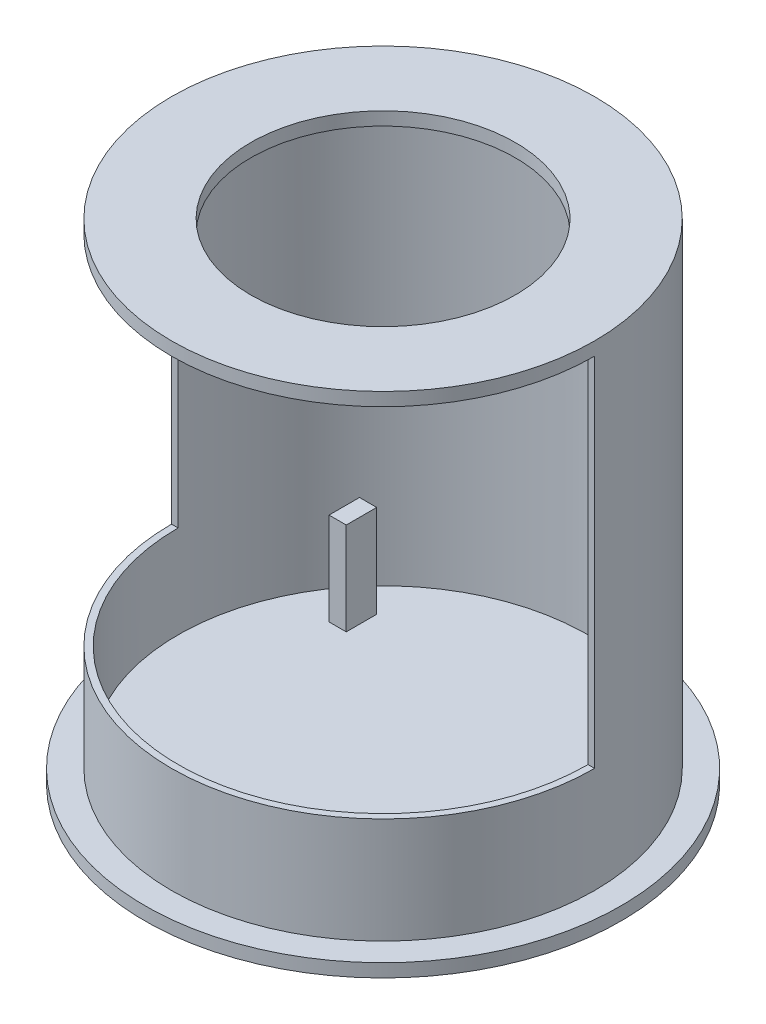
ISO-10303-21;
HEADER;
FILE_DESCRIPTION(('STEP AP214'),'2;1');
FILE_NAME('part.step','',(''),(''),'','','');
FILE_SCHEMA(('AUTOMOTIVE_DESIGN { 1 0 10303 214 1 1 1 1 }'));
ENDSEC;
DATA;
#1=APPLICATION_CONTEXT('core data for automotive mechanical design processes');
#2=APPLICATION_PROTOCOL_DEFINITION('international standard','automotive_design',2000,#1);
#3=PRODUCT_CONTEXT('',#1,'mechanical');
#4=PRODUCT('Part','Part','',(#3));
#5=PRODUCT_RELATED_PRODUCT_CATEGORY('part','',(#4));
#6=PRODUCT_DEFINITION_FORMATION('','',#4);
#7=PRODUCT_DEFINITION_CONTEXT('part definition',#1,'design');
#8=PRODUCT_DEFINITION('design','',#6,#7);
#9=PRODUCT_DEFINITION_SHAPE('','',#8);
#10=(LENGTH_UNIT() NAMED_UNIT(*) SI_UNIT(.MILLI.,.METRE.));
#11=(NAMED_UNIT(*) PLANE_ANGLE_UNIT() SI_UNIT($,.RADIAN.));
#12=(NAMED_UNIT(*) SI_UNIT($,.STERADIAN.) SOLID_ANGLE_UNIT());
#13=UNCERTAINTY_MEASURE_WITH_UNIT(LENGTH_MEASURE(1.E-05),#10,'distance_accuracy_value','');
#14=(GEOMETRIC_REPRESENTATION_CONTEXT(3) GLOBAL_UNCERTAINTY_ASSIGNED_CONTEXT((#13)) GLOBAL_UNIT_ASSIGNED_CONTEXT((#10,
#11,#12)) REPRESENTATION_CONTEXT('',''));
#15=CARTESIAN_POINT('',(0.,0.,0.));
#16=DIRECTION('',(0.,0.,1.));
#17=DIRECTION('',(1.,0.,0.));
#18=AXIS2_PLACEMENT_3D('',#15,#16,#17);
#19=CARTESIAN_POINT('',(0.,5.,0.));
#20=DIRECTION('',(0.,1.,0.));
#21=DIRECTION('',(0.,0.,1.));
#22=AXIS2_PLACEMENT_3D('',#19,#20,#21);
#23=PLANE('',#22);
#24=CARTESIAN_POINT('',(0.,5.,0.));
#25=DIRECTION('',(0.,1.,0.));
#26=DIRECTION('',(0.,0.,1.));
#27=AXIS2_PLACEMENT_3D('',#24,#25,#26);
#28=CIRCLE('',#27,77.5);
#29=CARTESIAN_POINT('',(0.,5.,77.5));
#30=VERTEX_POINT('',#29);
#31=EDGE_CURVE('E11',#30,#30,#28,.T.);
#32=ORIENTED_EDGE('',*,*,#31,.T.);
#33=EDGE_LOOP('',(#32));
#34=FACE_BOUND('',#33,.T.);
#35=DIRECTION('',(0.,0.,-1.));
#36=VECTOR('',#35,1.);
#37=CARTESIAN_POINT('',(-46.67,5.,0.));
#38=LINE('',#37,#36);
#39=CARTESIAN_POINT('',(-46.67,5.,-32.75));
#40=VERTEX_POINT('',#39);
#41=CARTESIAN_POINT('',(-46.67,5.,-44.2582298009128));
#42=VERTEX_POINT('',#41);
#43=EDGE_CURVE('E171',#40,#42,#38,.T.);
#44=ORIENTED_EDGE('',*,*,#43,.F.);
#45=DIRECTION('',(1.,0.,0.));
#46=VECTOR('',#45,1.);
#47=CARTESIAN_POINT('',(0.,5.,-32.7499999999999));
#48=LINE('',#47,#46);
#49=CARTESIAN_POINT('',(-53.17,5.,-32.75));
#50=VERTEX_POINT('',#49);
#51=EDGE_CURVE('E130',#50,#40,#48,.T.);
#52=ORIENTED_EDGE('',*,*,#51,.F.);
#53=DIRECTION('',(0.,0.,-1.));
#54=VECTOR('',#53,1.);
#55=CARTESIAN_POINT('',(-53.17,5.,0.));
#56=LINE('',#55,#54);
#57=CARTESIAN_POINT('',(-53.17,5.,-44.2582298009127));
#58=VERTEX_POINT('',#57);
#59=EDGE_CURVE('E160',#50,#58,#56,.T.);
#60=ORIENTED_EDGE('',*,*,#59,.T.);
#61=DIRECTION('',(1.,0.,0.));
#62=VECTOR('',#61,1.);
#63=CARTESIAN_POINT('',(0.,5.,-44.2582298009128));
#64=LINE('',#63,#62);
#65=EDGE_CURVE('E174',#58,#42,#64,.T.);
#66=ORIENTED_EDGE('',*,*,#65,.T.);
#67=EDGE_LOOP('',(#44,#52,#60,#66));
#68=FACE_BOUND('',#67,.T.);
#69=DIRECTION('',(0.,0.,1.));
#70=VECTOR('',#69,1.);
#71=CARTESIAN_POINT('',(46.67,5.,-44.26));
#72=LINE('',#71,#70);
#73=CARTESIAN_POINT('',(46.67,5.,-44.26));
#74=VERTEX_POINT('',#73);
#75=CARTESIAN_POINT('',(46.67,5.,-32.75));
#76=VERTEX_POINT('',#75);
#77=EDGE_CURVE('E52',#74,#76,#72,.T.);
#78=ORIENTED_EDGE('',*,*,#77,.F.);
#79=DIRECTION('',(-1.,0.,0.));
#80=VECTOR('',#79,1.);
#81=CARTESIAN_POINT('',(53.17,5.,-44.26));
#82=LINE('',#81,#80);
#83=CARTESIAN_POINT('',(53.17,5.,-44.26));
#84=VERTEX_POINT('',#83);
#85=EDGE_CURVE('E123',#84,#74,#82,.T.);
#86=ORIENTED_EDGE('',*,*,#85,.F.);
#87=DIRECTION('',(0.,0.,1.));
#88=VECTOR('',#87,1.);
#89=CARTESIAN_POINT('',(53.17,5.,-44.26));
#90=LINE('',#89,#88);
#91=CARTESIAN_POINT('',(53.17,5.,-32.75));
#92=VERTEX_POINT('',#91);
#93=EDGE_CURVE('E126',#84,#92,#90,.T.);
#94=ORIENTED_EDGE('',*,*,#93,.T.);
#95=DIRECTION('',(-1.,0.,0.));
#96=VECTOR('',#95,1.);
#97=CARTESIAN_POINT('',(53.17,5.,-32.75));
#98=LINE('',#97,#96);
#99=EDGE_CURVE('E57',#92,#76,#98,.T.);
#100=ORIENTED_EDGE('',*,*,#99,.T.);
#101=EDGE_LOOP('',(#78,#86,#94,#100));
#102=FACE_BOUND('',#101,.T.);
#103=ADVANCED_FACE('F37',(#34,#68,#102),#23,.T.);
#104=CARTESIAN_POINT('',(0.,5.,0.));
#105=DIRECTION('',(0.,0.,-1.));
#106=DIRECTION('',(-1.,0.,0.));
#107=AXIS2_PLACEMENT_3D('',#104,#105,#106);
#108=PLANE('',#107);
#109=DIRECTION('',(1.,0.,0.));
#110=VECTOR('',#109,1.);
#111=CARTESIAN_POINT('',(0.,175.,0.));
#112=LINE('',#111,#110);
#113=CARTESIAN_POINT('',(-80.,175.,0.));
#114=VERTEX_POINT('',#113);
#115=CARTESIAN_POINT('',(-77.5,175.,0.));
#116=VERTEX_POINT('',#115);
#117=EDGE_CURVE('E191',#114,#116,#112,.T.);
#118=ORIENTED_EDGE('',*,*,#117,.F.);
#119=DIRECTION('',(0.,-1.,0.));
#120=VECTOR('',#119,1.);
#121=CARTESIAN_POINT('',(-80.,180.,0.));
#122=LINE('',#121,#120);
#123=CARTESIAN_POINT('',(-80.,40.0000000000001,0.));
#124=VERTEX_POINT('',#123);
#125=EDGE_CURVE('E45',#114,#124,#122,.T.);
#126=ORIENTED_EDGE('',*,*,#125,.T.);
#127=DIRECTION('',(-1.,0.,0.));
#128=VECTOR('',#127,1.);
#129=CARTESIAN_POINT('',(0.,40.,0.));
#130=LINE('',#129,#128);
#131=CARTESIAN_POINT('',(-77.5,40.0000000000001,0.));
#132=VERTEX_POINT('',#131);
#133=EDGE_CURVE('E210',#132,#124,#130,.T.);
#134=ORIENTED_EDGE('',*,*,#133,.F.);
#135=DIRECTION('',(0.,-1.,0.));
#136=VECTOR('',#135,1.);
#137=CARTESIAN_POINT('',(-77.5,180.,0.));
#138=LINE('',#137,#136);
#139=EDGE_CURVE('E230',#116,#132,#138,.T.);
#140=ORIENTED_EDGE('',*,*,#139,.F.);
#141=EDGE_LOOP('',(#118,#126,#134,#140));
#142=FACE_BOUND('',#141,.T.);
#143=ADVANCED_FACE('F39',(#142),#108,.F.);
#144=DIRECTION('',(1.,0.,0.));
#145=VECTOR('',#144,1.);
#146=CARTESIAN_POINT('',(0.,175.,0.));
#147=LINE('',#146,#145);
#148=CARTESIAN_POINT('',(77.5,175.,0.));
#149=VERTEX_POINT('',#148);
#150=CARTESIAN_POINT('',(80.,175.,0.));
#151=VERTEX_POINT('',#150);
#152=EDGE_CURVE('E188',#149,#151,#147,.T.);
#153=ORIENTED_EDGE('',*,*,#152,.F.);
#154=DIRECTION('',(0.,-1.,0.));
#155=VECTOR('',#154,1.);
#156=CARTESIAN_POINT('',(77.5,180.,0.));
#157=LINE('',#156,#155);
#158=CARTESIAN_POINT('',(77.5,40.,0.));
#159=VERTEX_POINT('',#158);
#160=EDGE_CURVE('E233',#149,#159,#157,.T.);
#161=ORIENTED_EDGE('',*,*,#160,.T.);
#162=DIRECTION('',(1.,0.,0.));
#163=VECTOR('',#162,1.);
#164=CARTESIAN_POINT('',(0.,40.,0.));
#165=LINE('',#164,#163);
#166=CARTESIAN_POINT('',(80.,40.,0.));
#167=VERTEX_POINT('',#166);
#168=EDGE_CURVE('E204',#159,#167,#165,.T.);
#169=ORIENTED_EDGE('',*,*,#168,.T.);
#170=DIRECTION('',(0.,-1.,0.));
#171=VECTOR('',#170,1.);
#172=CARTESIAN_POINT('',(80.,180.,0.));
#173=LINE('',#172,#171);
#174=EDGE_CURVE('E228',#151,#167,#173,.T.);
#175=ORIENTED_EDGE('',*,*,#174,.F.);
#176=EDGE_LOOP('',(#153,#161,#169,#175));
#177=FACE_BOUND('',#176,.T.);
#178=ADVANCED_FACE('F245',(#177),#108,.F.);
#179=CARTESIAN_POINT('',(0.,180.,0.));
#180=DIRECTION('',(0.,-1.,0.));
#181=DIRECTION('',(0.,0.,-1.));
#182=AXIS2_PLACEMENT_3D('',#179,#180,#181);
#183=CYLINDRICAL_SURFACE('',#182,77.5);
#184=ORIENTED_EDGE('',*,*,#31,.F.);
#185=EDGE_LOOP('',(#184));
#186=FACE_BOUND('',#185,.T.);
#187=CARTESIAN_POINT('',(0.,175.,0.));
#188=DIRECTION('',(0.,1.,0.));
#189=DIRECTION('',(0.,0.,1.));
#190=AXIS2_PLACEMENT_3D('',#187,#188,#189);
#191=CIRCLE('',#190,77.5);
#192=EDGE_CURVE('E220',#149,#116,#191,.T.);
#193=ORIENTED_EDGE('',*,*,#192,.T.);
#194=ORIENTED_EDGE('',*,*,#139,.T.);
#195=CARTESIAN_POINT('',(0.,40.,0.));
#196=DIRECTION('',(0.,1.,0.));
#197=DIRECTION('',(0.,0.,1.));
#198=AXIS2_PLACEMENT_3D('',#195,#196,#197);
#199=CIRCLE('',#198,77.5);
#200=EDGE_CURVE('E207',#159,#132,#199,.F.);
#201=ORIENTED_EDGE('',*,*,#200,.F.);
#202=ORIENTED_EDGE('',*,*,#160,.F.);
#203=EDGE_LOOP('',(#193,#194,#201,#202));
#204=FACE_BOUND('',#203,.T.);
#205=ADVANCED_FACE('F249',(#186,#204),#183,.F.);
#206=CARTESIAN_POINT('',(0.,180.,0.));
#207=DIRECTION('',(0.,-1.,0.));
#208=DIRECTION('',(0.,0.,-1.));
#209=AXIS2_PLACEMENT_3D('',#206,#207,#208);
#210=CYLINDRICAL_SURFACE('',#209,80.);
#211=CARTESIAN_POINT('',(0.,175.,0.));
#212=DIRECTION('',(0.,1.,0.));
#213=DIRECTION('',(0.,0.,1.));
#214=AXIS2_PLACEMENT_3D('',#211,#212,#213);
#215=CIRCLE('',#214,80.);
#216=EDGE_CURVE('E193',#151,#114,#215,.F.);
#217=ORIENTED_EDGE('',*,*,#216,.F.);
#218=ORIENTED_EDGE('',*,*,#174,.T.);
#219=CARTESIAN_POINT('',(0.,40.,0.));
#220=DIRECTION('',(0.,1.,0.));
#221=DIRECTION('',(0.,0.,1.));
#222=AXIS2_PLACEMENT_3D('',#219,#220,#221);
#223=CIRCLE('',#222,80.);
#224=EDGE_CURVE('E213',#167,#124,#223,.F.);
#225=ORIENTED_EDGE('',*,*,#224,.T.);
#226=ORIENTED_EDGE('',*,*,#125,.F.);
#227=EDGE_LOOP('',(#217,#218,#225,#226));
#228=FACE_BOUND('',#227,.T.);
#229=CARTESIAN_POINT('',(0.,0.,0.));
#230=DIRECTION('',(0.,-1.,0.));
#231=DIRECTION('',(0.,0.,-1.));
#232=AXIS2_PLACEMENT_3D('',#229,#230,#231);
#233=CIRCLE('',#232,80.);
#234=CARTESIAN_POINT('',(0.,0.,-80.));
#235=VERTEX_POINT('',#234);
#236=EDGE_CURVE('E199',#235,#235,#233,.T.);
#237=ORIENTED_EDGE('',*,*,#236,.F.);
#238=EDGE_LOOP('',(#237));
#239=FACE_BOUND('',#238,.T.);
#240=CARTESIAN_POINT('',(0.,180.,0.));
#241=DIRECTION('',(0.,-1.,0.));
#242=DIRECTION('',(0.,0.,-1.));
#243=AXIS2_PLACEMENT_3D('',#240,#241,#242);
#244=CIRCLE('',#243,80.);
#245=CARTESIAN_POINT('',(0.,180.,-80.));
#246=VERTEX_POINT('',#245);
#247=EDGE_CURVE('E225',#246,#246,#244,.F.);
#248=ORIENTED_EDGE('',*,*,#247,.F.);
#249=EDGE_LOOP('',(#248));
#250=FACE_BOUND('',#249,.T.);
#251=ADVANCED_FACE('F238',(#228,#239,#250),#210,.T.);
#252=CARTESIAN_POINT('',(0.,180.,0.));
#253=DIRECTION('',(0.,-1.,0.));
#254=DIRECTION('',(0.,0.,-1.));
#255=AXIS2_PLACEMENT_3D('',#252,#253,#254);
#256=PLANE('',#255);
#257=ORIENTED_EDGE('',*,*,#247,.T.);
#258=EDGE_LOOP('',(#257));
#259=FACE_BOUND('',#258,.T.);
#260=CARTESIAN_POINT('',(0.,180.,0.));
#261=DIRECTION('',(0.,1.,0.));
#262=DIRECTION('',(0.,0.,1.));
#263=AXIS2_PLACEMENT_3D('',#260,#261,#262);
#264=CIRCLE('',#263,50.);
#265=CARTESIAN_POINT('',(0.,180.,50.));
#266=VERTEX_POINT('',#265);
#267=EDGE_CURVE('E216',#266,#266,#264,.T.);
#268=ORIENTED_EDGE('',*,*,#267,.F.);
#269=EDGE_LOOP('',(#268));
#270=FACE_BOUND('',#269,.T.);
#271=ADVANCED_FACE('F257',(#259,#270),#256,.F.);
#272=CARTESIAN_POINT('',(0.,175.,0.));
#273=DIRECTION('',(0.,1.,0.));
#274=DIRECTION('',(0.,0.,1.));
#275=AXIS2_PLACEMENT_3D('',#272,#273,#274);
#276=PLANE('',#275);
#277=CARTESIAN_POINT('',(0.,175.,0.));
#278=DIRECTION('',(0.,1.,0.));
#279=DIRECTION('',(0.,0.,1.));
#280=AXIS2_PLACEMENT_3D('',#277,#278,#279);
#281=CIRCLE('',#280,50.);
#282=CARTESIAN_POINT('',(0.,175.,50.));
#283=VERTEX_POINT('',#282);
#284=EDGE_CURVE('E217',#283,#283,#281,.T.);
#285=ORIENTED_EDGE('',*,*,#284,.T.);
#286=EDGE_LOOP('',(#285));
#287=FACE_BOUND('',#286,.T.);
#288=ORIENTED_EDGE('',*,*,#192,.F.);
#289=ORIENTED_EDGE('',*,*,#152,.T.);
#290=ORIENTED_EDGE('',*,*,#216,.T.);
#291=ORIENTED_EDGE('',*,*,#117,.T.);
#292=EDGE_LOOP('',(#288,#289,#290,#291));
#293=FACE_BOUND('',#292,.T.);
#294=ADVANCED_FACE('F254',(#287,#293),#276,.F.);
#295=CARTESIAN_POINT('',(0.,175.,0.));
#296=DIRECTION('',(0.,1.,0.));
#297=DIRECTION('',(0.,0.,1.));
#298=AXIS2_PLACEMENT_3D('',#295,#296,#297);
#299=CYLINDRICAL_SURFACE('',#298,50.);
#300=ORIENTED_EDGE('',*,*,#267,.T.);
#301=EDGE_LOOP('',(#300));
#302=FACE_BOUND('',#301,.T.);
#303=ORIENTED_EDGE('',*,*,#284,.F.);
#304=EDGE_LOOP('',(#303));
#305=FACE_BOUND('',#304,.T.);
#306=ADVANCED_FACE('F256',(#302,#305),#299,.F.);
#307=CARTESIAN_POINT('',(0.,40.,0.));
#308=DIRECTION('',(0.,1.,0.));
#309=DIRECTION('',(0.,0.,1.));
#310=AXIS2_PLACEMENT_3D('',#307,#308,#309);
#311=PLANE('',#310);
#312=ORIENTED_EDGE('',*,*,#168,.F.);
#313=ORIENTED_EDGE('',*,*,#200,.T.);
#314=ORIENTED_EDGE('',*,*,#133,.T.);
#315=ORIENTED_EDGE('',*,*,#224,.F.);
#316=EDGE_LOOP('',(#312,#313,#314,#315));
#317=FACE_BOUND('',#316,.T.);
#318=ADVANCED_FACE('F244',(#317),#311,.T.);
#319=CARTESIAN_POINT('',(0.,-5.,0.));
#320=DIRECTION('',(0.,1.,0.));
#321=DIRECTION('',(0.,0.,1.));
#322=AXIS2_PLACEMENT_3D('',#319,#320,#321);
#323=CYLINDRICAL_SURFACE('',#322,90.);
#324=CARTESIAN_POINT('',(0.,-5.,0.));
#325=DIRECTION('',(0.,-1.,0.));
#326=DIRECTION('',(0.,0.,-1.));
#327=AXIS2_PLACEMENT_3D('',#324,#325,#326);
#328=CIRCLE('',#327,90.);
#329=CARTESIAN_POINT('',(0.,-5.,-90.));
#330=VERTEX_POINT('',#329);
#331=EDGE_CURVE('E196',#330,#330,#328,.T.);
#332=ORIENTED_EDGE('',*,*,#331,.F.);
#333=EDGE_LOOP('',(#332));
#334=FACE_BOUND('',#333,.T.);
#335=CARTESIAN_POINT('',(0.,0.,0.));
#336=DIRECTION('',(0.,-1.,0.));
#337=DIRECTION('',(0.,0.,-1.));
#338=AXIS2_PLACEMENT_3D('',#335,#336,#337);
#339=CIRCLE('',#338,90.);
#340=CARTESIAN_POINT('',(0.,0.,-90.));
#341=VERTEX_POINT('',#340);
#342=EDGE_CURVE('E195',#341,#341,#339,.T.);
#343=ORIENTED_EDGE('',*,*,#342,.T.);
#344=EDGE_LOOP('',(#343));
#345=FACE_BOUND('',#344,.T.);
#346=ADVANCED_FACE('F314',(#334,#345),#323,.T.);
#347=CARTESIAN_POINT('',(0.,-5.,0.));
#348=DIRECTION('',(0.,-1.,0.));
#349=DIRECTION('',(0.,0.,-1.));
#350=AXIS2_PLACEMENT_3D('',#347,#348,#349);
#351=PLANE('',#350);
#352=ORIENTED_EDGE('',*,*,#331,.T.);
#353=EDGE_LOOP('',(#352));
#354=FACE_BOUND('',#353,.T.);
#355=ADVANCED_FACE('F302',(#354),#351,.T.);
#356=CARTESIAN_POINT('',(0.,0.,0.));
#357=DIRECTION('',(0.,-1.,0.));
#358=DIRECTION('',(0.,0.,-1.));
#359=AXIS2_PLACEMENT_3D('',#356,#357,#358);
#360=PLANE('',#359);
#361=ORIENTED_EDGE('',*,*,#236,.T.);
#362=EDGE_LOOP('',(#361));
#363=FACE_BOUND('',#362,.T.);
#364=ORIENTED_EDGE('',*,*,#342,.F.);
#365=EDGE_LOOP('',(#364));
#366=FACE_BOUND('',#365,.T.);
#367=ADVANCED_FACE('F296',(#363,#366),#360,.F.);
#368=CARTESIAN_POINT('',(0.,40.,-32.7499999999999));
#369=DIRECTION('',(0.,0.,-1.));
#370=DIRECTION('',(-1.,0.,0.));
#371=AXIS2_PLACEMENT_3D('',#368,#369,#370);
#372=PLANE('',#371);
#373=ORIENTED_EDGE('',*,*,#51,.T.);
#374=DIRECTION('',(0.,-1.,0.));
#375=VECTOR('',#374,1.);
#376=CARTESIAN_POINT('',(-46.67,40.,-32.75));
#377=LINE('',#376,#375);
#378=CARTESIAN_POINT('',(-46.67,40.,-32.75));
#379=VERTEX_POINT('',#378);
#380=EDGE_CURVE('E185',#379,#40,#377,.T.);
#381=ORIENTED_EDGE('',*,*,#380,.F.);
#382=DIRECTION('',(1.,0.,0.));
#383=VECTOR('',#382,1.);
#384=CARTESIAN_POINT('',(0.,40.,-32.7499999999999));
#385=LINE('',#384,#383);
#386=CARTESIAN_POINT('',(-53.17,40.,-32.75));
#387=VERTEX_POINT('',#386);
#388=EDGE_CURVE('E156',#387,#379,#385,.T.);
#389=ORIENTED_EDGE('',*,*,#388,.F.);
#390=DIRECTION('',(0.,-1.,0.));
#391=VECTOR('',#390,1.);
#392=CARTESIAN_POINT('',(-53.17,40.,-32.75));
#393=LINE('',#392,#391);
#394=EDGE_CURVE('E168',#387,#50,#393,.T.);
#395=ORIENTED_EDGE('',*,*,#394,.T.);
#396=EDGE_LOOP('',(#373,#381,#389,#395));
#397=FACE_BOUND('',#396,.T.);
#398=ADVANCED_FACE('F301',(#397),#372,.F.);
#399=CARTESIAN_POINT('',(-46.67,40.,0.));
#400=DIRECTION('',(-1.,0.,0.));
#401=DIRECTION('',(0.,0.,1.));
#402=AXIS2_PLACEMENT_3D('',#399,#400,#401);
#403=PLANE('',#402);
#404=ORIENTED_EDGE('',*,*,#43,.T.);
#405=DIRECTION('',(0.,-1.,0.));
#406=VECTOR('',#405,1.);
#407=CARTESIAN_POINT('',(-46.67,40.,-44.2582298009128));
#408=LINE('',#407,#406);
#409=CARTESIAN_POINT('',(-46.67,40.,-44.2582298009128));
#410=VERTEX_POINT('',#409);
#411=EDGE_CURVE('E182',#410,#42,#408,.T.);
#412=ORIENTED_EDGE('',*,*,#411,.F.);
#413=DIRECTION('',(0.,0.,-1.));
#414=VECTOR('',#413,1.);
#415=CARTESIAN_POINT('',(-46.67,40.,0.));
#416=LINE('',#415,#414);
#417=EDGE_CURVE('E159',#379,#410,#416,.T.);
#418=ORIENTED_EDGE('',*,*,#417,.F.);
#419=ORIENTED_EDGE('',*,*,#380,.T.);
#420=EDGE_LOOP('',(#404,#412,#418,#419));
#421=FACE_BOUND('',#420,.T.);
#422=ADVANCED_FACE('F356',(#421),#403,.F.);
#423=CARTESIAN_POINT('',(0.,40.,-44.2582298009128));
#424=DIRECTION('',(0.,0.,-1.));
#425=DIRECTION('',(-1.,0.,0.));
#426=AXIS2_PLACEMENT_3D('',#423,#424,#425);
#427=PLANE('',#426);
#428=ORIENTED_EDGE('',*,*,#65,.F.);
#429=DIRECTION('',(0.,-1.,0.));
#430=VECTOR('',#429,1.);
#431=CARTESIAN_POINT('',(-53.17,40.,-44.2582298009127));
#432=LINE('',#431,#430);
#433=CARTESIAN_POINT('',(-53.17,40.,-44.2582298009127));
#434=VERTEX_POINT('',#433);
#435=EDGE_CURVE('E179',#434,#58,#432,.T.);
#436=ORIENTED_EDGE('',*,*,#435,.F.);
#437=DIRECTION('',(1.,0.,0.));
#438=VECTOR('',#437,1.);
#439=CARTESIAN_POINT('',(0.,40.,-44.2582298009128));
#440=LINE('',#439,#438);
#441=EDGE_CURVE('E162',#434,#410,#440,.T.);
#442=ORIENTED_EDGE('',*,*,#441,.T.);
#443=ORIENTED_EDGE('',*,*,#411,.T.);
#444=EDGE_LOOP('',(#428,#436,#442,#443));
#445=FACE_BOUND('',#444,.T.);
#446=ADVANCED_FACE('F366',(#445),#427,.T.);
#447=CARTESIAN_POINT('',(-53.17,40.,0.));
#448=DIRECTION('',(-1.,0.,0.));
#449=DIRECTION('',(0.,0.,1.));
#450=AXIS2_PLACEMENT_3D('',#447,#448,#449);
#451=PLANE('',#450);
#452=ORIENTED_EDGE('',*,*,#59,.F.);
#453=ORIENTED_EDGE('',*,*,#394,.F.);
#454=DIRECTION('',(0.,0.,-1.));
#455=VECTOR('',#454,1.);
#456=CARTESIAN_POINT('',(-53.17,40.,0.));
#457=LINE('',#456,#455);
#458=EDGE_CURVE('E165',#387,#434,#457,.T.);
#459=ORIENTED_EDGE('',*,*,#458,.T.);
#460=ORIENTED_EDGE('',*,*,#435,.T.);
#461=EDGE_LOOP('',(#452,#453,#459,#460));
#462=FACE_BOUND('',#461,.T.);
#463=ADVANCED_FACE('F376',(#462),#451,.T.);
#464=CARTESIAN_POINT('',(0.,40.,0.));
#465=DIRECTION('',(0.,1.,0.));
#466=DIRECTION('',(0.,0.,1.));
#467=AXIS2_PLACEMENT_3D('',#464,#465,#466);
#468=PLANE('',#467);
#469=ORIENTED_EDGE('',*,*,#388,.T.);
#470=ORIENTED_EDGE('',*,*,#417,.T.);
#471=ORIENTED_EDGE('',*,*,#441,.F.);
#472=ORIENTED_EDGE('',*,*,#458,.F.);
#473=EDGE_LOOP('',(#469,#470,#471,#472));
#474=FACE_BOUND('',#473,.T.);
#475=ADVANCED_FACE('F386',(#474),#468,.T.);
#476=CARTESIAN_POINT('',(53.17,40.,-44.26));
#477=DIRECTION('',(0.,0.,1.));
#478=DIRECTION('',(1.,0.,0.));
#479=AXIS2_PLACEMENT_3D('',#476,#477,#478);
#480=PLANE('',#479);
#481=ORIENTED_EDGE('',*,*,#85,.T.);
#482=DIRECTION('',(0.,-1.,0.));
#483=VECTOR('',#482,1.);
#484=CARTESIAN_POINT('',(46.67,40.,-44.26));
#485=LINE('',#484,#483);
#486=CARTESIAN_POINT('',(46.67,40.,-44.26));
#487=VERTEX_POINT('',#486);
#488=EDGE_CURVE('E448',#487,#74,#485,.T.);
#489=ORIENTED_EDGE('',*,*,#488,.F.);
#490=DIRECTION('',(-1.,0.,0.));
#491=VECTOR('',#490,1.);
#492=CARTESIAN_POINT('',(53.17,40.,-44.26));
#493=LINE('',#492,#491);
#494=CARTESIAN_POINT('',(53.17,40.,-44.26));
#495=VERTEX_POINT('',#494);
#496=EDGE_CURVE('E136',#495,#487,#493,.T.);
#497=ORIENTED_EDGE('',*,*,#496,.F.);
#498=DIRECTION('',(0.,-1.,0.));
#499=VECTOR('',#498,1.);
#500=CARTESIAN_POINT('',(53.17,40.,-44.26));
#501=LINE('',#500,#499);
#502=EDGE_CURVE('E133',#495,#84,#501,.T.);
#503=ORIENTED_EDGE('',*,*,#502,.T.);
#504=EDGE_LOOP('',(#481,#489,#497,#503));
#505=FACE_BOUND('',#504,.T.);
#506=ADVANCED_FACE('F134',(#505),#480,.F.);
#507=CARTESIAN_POINT('',(46.67,40.,-44.26));
#508=DIRECTION('',(1.,0.,0.));
#509=DIRECTION('',(0.,0.,-1.));
#510=AXIS2_PLACEMENT_3D('',#507,#508,#509);
#511=PLANE('',#510);
#512=ORIENTED_EDGE('',*,*,#77,.T.);
#513=DIRECTION('',(0.,-1.,0.));
#514=VECTOR('',#513,1.);
#515=CARTESIAN_POINT('',(46.67,40.,-32.75));
#516=LINE('',#515,#514);
#517=CARTESIAN_POINT('',(46.67,40.,-32.75));
#518=VERTEX_POINT('',#517);
#519=EDGE_CURVE('E449',#518,#76,#516,.T.);
#520=ORIENTED_EDGE('',*,*,#519,.F.);
#521=DIRECTION('',(0.,0.,1.));
#522=VECTOR('',#521,1.);
#523=CARTESIAN_POINT('',(46.67,40.,-44.26));
#524=LINE('',#523,#522);
#525=EDGE_CURVE('E146',#487,#518,#524,.T.);
#526=ORIENTED_EDGE('',*,*,#525,.F.);
#527=ORIENTED_EDGE('',*,*,#488,.T.);
#528=EDGE_LOOP('',(#512,#520,#526,#527));
#529=FACE_BOUND('',#528,.T.);
#530=ADVANCED_FACE('F405',(#529),#511,.F.);
#531=CARTESIAN_POINT('',(53.17,40.,-32.75));
#532=DIRECTION('',(0.,0.,1.));
#533=DIRECTION('',(1.,0.,0.));
#534=AXIS2_PLACEMENT_3D('',#531,#532,#533);
#535=PLANE('',#534);
#536=ORIENTED_EDGE('',*,*,#99,.F.);
#537=DIRECTION('',(0.,-1.,0.));
#538=VECTOR('',#537,1.);
#539=CARTESIAN_POINT('',(53.17,40.,-32.75));
#540=LINE('',#539,#538);
#541=CARTESIAN_POINT('',(53.17,40.,-32.75));
#542=VERTEX_POINT('',#541);
#543=EDGE_CURVE('E141',#542,#92,#540,.T.);
#544=ORIENTED_EDGE('',*,*,#543,.F.);
#545=DIRECTION('',(-1.,0.,0.));
#546=VECTOR('',#545,1.);
#547=CARTESIAN_POINT('',(53.17,40.,-32.75));
#548=LINE('',#547,#546);
#549=EDGE_CURVE('E152',#542,#518,#548,.T.);
#550=ORIENTED_EDGE('',*,*,#549,.T.);
#551=ORIENTED_EDGE('',*,*,#519,.T.);
#552=EDGE_LOOP('',(#536,#544,#550,#551));
#553=FACE_BOUND('',#552,.T.);
#554=ADVANCED_FACE('F414',(#553),#535,.T.);
#555=CARTESIAN_POINT('',(53.17,40.,-44.26));
#556=DIRECTION('',(1.,0.,0.));
#557=DIRECTION('',(0.,0.,-1.));
#558=AXIS2_PLACEMENT_3D('',#555,#556,#557);
#559=PLANE('',#558);
#560=ORIENTED_EDGE('',*,*,#93,.F.);
#561=ORIENTED_EDGE('',*,*,#502,.F.);
#562=DIRECTION('',(0.,0.,1.));
#563=VECTOR('',#562,1.);
#564=CARTESIAN_POINT('',(53.17,40.,-44.26));
#565=LINE('',#564,#563);
#566=EDGE_CURVE('E140',#495,#542,#565,.T.);
#567=ORIENTED_EDGE('',*,*,#566,.T.);
#568=ORIENTED_EDGE('',*,*,#543,.T.);
#569=EDGE_LOOP('',(#560,#561,#567,#568));
#570=FACE_BOUND('',#569,.T.);
#571=ADVANCED_FACE('F143',(#570),#559,.T.);
#572=CARTESIAN_POINT('',(0.,40.,0.));
#573=DIRECTION('',(0.,1.,0.));
#574=DIRECTION('',(0.,0.,1.));
#575=AXIS2_PLACEMENT_3D('',#572,#573,#574);
#576=PLANE('',#575);
#577=ORIENTED_EDGE('',*,*,#496,.T.);
#578=ORIENTED_EDGE('',*,*,#525,.T.);
#579=ORIENTED_EDGE('',*,*,#549,.F.);
#580=ORIENTED_EDGE('',*,*,#566,.F.);
#581=EDGE_LOOP('',(#577,#578,#579,#580));
#582=FACE_BOUND('',#581,.T.);
#583=ADVANCED_FACE('F433',(#582),#576,.T.);
#584=CLOSED_SHELL('',(#103,#143,#178,#205,#251,#271,#294,#306,#318,#346,#355,#367,#398,#422,
#446,#463,#475,#506,#530,#554,#571,#583));
#585=MANIFOLD_SOLID_BREP('B2',#584);
#586=ADVANCED_BREP_SHAPE_REPRESENTATION('',(#18,#585),#14);
#587=SHAPE_DEFINITION_REPRESENTATION(#9,#586);
ENDSEC;
END-ISO-10303-21;
